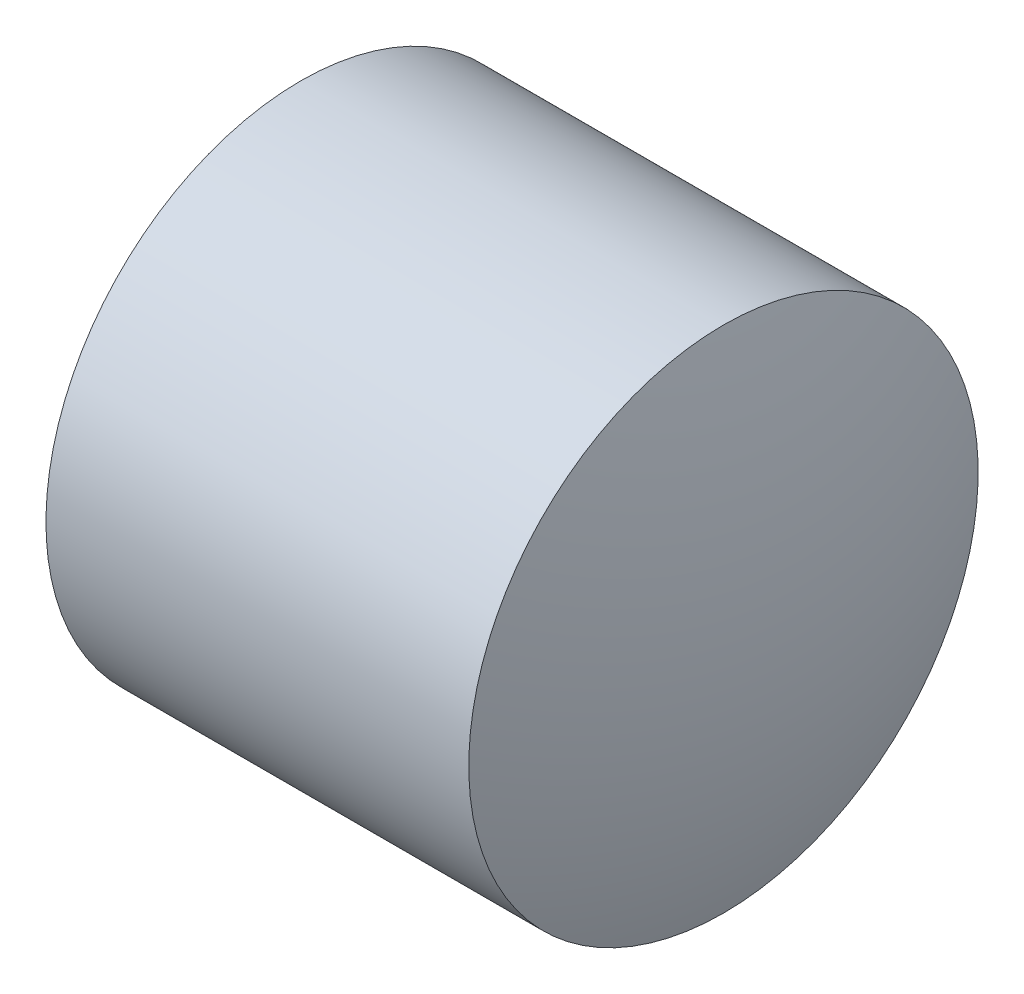
ISO-10303-21;
HEADER;
FILE_DESCRIPTION(('STEP AP214'),'2;1');
FILE_NAME('part.step','',(''),(''),'','','');
FILE_SCHEMA(('AUTOMOTIVE_DESIGN { 1 0 10303 214 1 1 1 1 }'));
ENDSEC;
DATA;
#1=APPLICATION_CONTEXT('core data for automotive mechanical design processes');
#2=APPLICATION_PROTOCOL_DEFINITION('international standard','automotive_design',2000,#1);
#3=PRODUCT_CONTEXT('',#1,'mechanical');
#4=PRODUCT('Part','Part','',(#3));
#5=PRODUCT_RELATED_PRODUCT_CATEGORY('part','',(#4));
#6=PRODUCT_DEFINITION_FORMATION('','',#4);
#7=PRODUCT_DEFINITION_CONTEXT('part definition',#1,'design');
#8=PRODUCT_DEFINITION('design','',#6,#7);
#9=PRODUCT_DEFINITION_SHAPE('','',#8);
#10=(LENGTH_UNIT() NAMED_UNIT(*) SI_UNIT(.MILLI.,.METRE.));
#11=(NAMED_UNIT(*) PLANE_ANGLE_UNIT() SI_UNIT($,.RADIAN.));
#12=(NAMED_UNIT(*) SI_UNIT($,.STERADIAN.) SOLID_ANGLE_UNIT());
#13=UNCERTAINTY_MEASURE_WITH_UNIT(LENGTH_MEASURE(1.E-05),#10,'distance_accuracy_value','');
#14=(GEOMETRIC_REPRESENTATION_CONTEXT(3) GLOBAL_UNCERTAINTY_ASSIGNED_CONTEXT((#13)) GLOBAL_UNIT_ASSIGNED_CONTEXT((#10,
#11,#12)) REPRESENTATION_CONTEXT('',''));
#15=CARTESIAN_POINT('',(0.,0.,0.));
#16=DIRECTION('',(0.,0.,1.));
#17=DIRECTION('',(1.,0.,0.));
#18=AXIS2_PLACEMENT_3D('',#15,#16,#17);
#19=CARTESIAN_POINT('',(14.3445327244984,11.4841251398063,0.));
#20=DIRECTION('',(1.,0.,0.));
#21=DIRECTION('',(0.,-1.,0.));
#22=AXIS2_PLACEMENT_3D('',#19,#20,#21);
#23=SPHERICAL_SURFACE('',#22,9.07866214697646);
#24=CARTESIAN_POINT('',(22.9132024102038,11.4841251398063,0.));
#25=DIRECTION('',(1.,0.,0.));
#26=DIRECTION('',(0.,1.,0.));
#27=AXIS2_PLACEMENT_3D('',#24,#25,#26);
#28=CIRCLE('',#27,3.00000103270259);
#29=CARTESIAN_POINT('',(22.9132024102038,14.4841261725089,0.));
#30=VERTEX_POINT('',#29);
#31=EDGE_CURVE('E10',#30,#30,#28,.T.);
#32=ORIENTED_EDGE('',*,*,#31,.T.);
#33=EDGE_LOOP('',(#32));
#34=FACE_BOUND('',#33,.T.);
#35=ADVANCED_FACE('F35',(#34),#23,.T.);
#36=CARTESIAN_POINT('',(23.7753036299441,11.4841251398063,0.));
#37=DIRECTION('',(1.,0.,0.));
#38=DIRECTION('',(0.,1.,0.));
#39=AXIS2_PLACEMENT_3D('',#36,#37,#38);
#40=CYLINDRICAL_SURFACE('',#39,3.00000103270259);
#41=ORIENTED_EDGE('',*,*,#31,.F.);
#42=EDGE_LOOP('',(#41));
#43=FACE_BOUND('',#42,.T.);
#44=CARTESIAN_POINT('',(17.9332024102038,11.4841251398063,0.));
#45=DIRECTION('',(1.,0.,0.));
#46=DIRECTION('',(0.,1.,0.));
#47=AXIS2_PLACEMENT_3D('',#44,#45,#46);
#48=CIRCLE('',#47,3.0000010327026);
#49=CARTESIAN_POINT('',(17.9332024102038,14.4841261725089,0.));
#50=VERTEX_POINT('',#49);
#51=EDGE_CURVE('E41',#50,#50,#48,.T.);
#52=ORIENTED_EDGE('',*,*,#51,.T.);
#53=EDGE_LOOP('',(#52));
#54=FACE_BOUND('',#53,.T.);
#55=ADVANCED_FACE('F47',(#43,#54),#40,.T.);
#56=CARTESIAN_POINT('',(26.5018720959091,11.4841251398063,0.));
#57=DIRECTION('',(1.,0.,0.));
#58=DIRECTION('',(0.,1.,0.));
#59=AXIS2_PLACEMENT_3D('',#56,#57,#58);
#60=SPHERICAL_SURFACE('',#59,9.07866214697636);
#61=ORIENTED_EDGE('',*,*,#51,.F.);
#62=EDGE_LOOP('',(#61));
#63=FACE_BOUND('',#62,.T.);
#64=ADVANCED_FACE('F49',(#63),#60,.T.);
#65=CLOSED_SHELL('',(#35,#55,#64));
#66=MANIFOLD_SOLID_BREP('B2',#65);
#67=ADVANCED_BREP_SHAPE_REPRESENTATION('',(#18,#66),#14);
#68=SHAPE_DEFINITION_REPRESENTATION(#9,#67);
ENDSEC;
END-ISO-10303-21;
